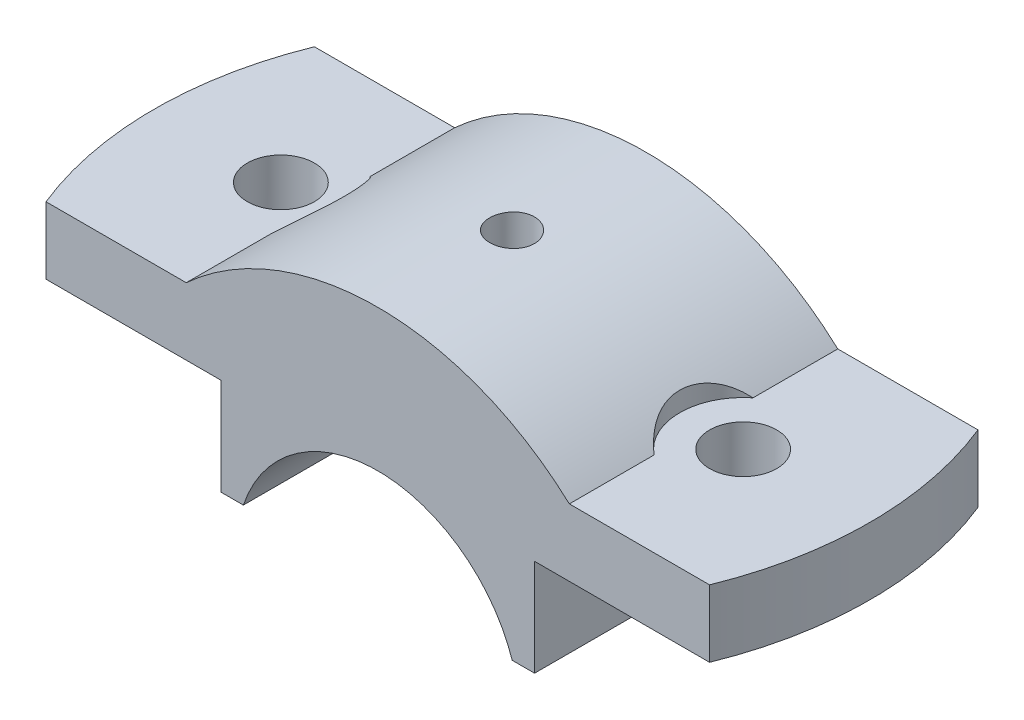
ISO-10303-21;
HEADER;
FILE_DESCRIPTION(('STEP AP214'),'2;1');
FILE_NAME('part.step','',(''),(''),'','','');
FILE_SCHEMA(('AUTOMOTIVE_DESIGN { 1 0 10303 214 1 1 1 1 }'));
ENDSEC;
DATA;
#1=APPLICATION_CONTEXT('core data for automotive mechanical design processes');
#2=APPLICATION_PROTOCOL_DEFINITION('international standard','automotive_design',2000,#1);
#3=PRODUCT_CONTEXT('',#1,'mechanical');
#4=PRODUCT('Part','Part','',(#3));
#5=PRODUCT_RELATED_PRODUCT_CATEGORY('part','',(#4));
#6=PRODUCT_DEFINITION_FORMATION('','',#4);
#7=PRODUCT_DEFINITION_CONTEXT('part definition',#1,'design');
#8=PRODUCT_DEFINITION('design','',#6,#7);
#9=PRODUCT_DEFINITION_SHAPE('','',#8);
#10=(LENGTH_UNIT() NAMED_UNIT(*) SI_UNIT(.MILLI.,.METRE.));
#11=(NAMED_UNIT(*) PLANE_ANGLE_UNIT() SI_UNIT($,.RADIAN.));
#12=(NAMED_UNIT(*) SI_UNIT($,.STERADIAN.) SOLID_ANGLE_UNIT());
#13=UNCERTAINTY_MEASURE_WITH_UNIT(LENGTH_MEASURE(1.E-05),#10,'distance_accuracy_value','');
#14=(GEOMETRIC_REPRESENTATION_CONTEXT(3) GLOBAL_UNCERTAINTY_ASSIGNED_CONTEXT((#13)) GLOBAL_UNIT_ASSIGNED_CONTEXT((#10,
#11,#12)) REPRESENTATION_CONTEXT('',''));
#15=CARTESIAN_POINT('',(0.,0.,0.));
#16=DIRECTION('',(0.,0.,1.));
#17=DIRECTION('',(1.,0.,0.));
#18=AXIS2_PLACEMENT_3D('',#15,#16,#17);
#19=CARTESIAN_POINT('',(50.,28.,18.));
#20=DIRECTION('',(0.,-1.,0.));
#21=DIRECTION('',(0.,0.,-1.));
#22=AXIS2_PLACEMENT_3D('',#19,#20,#21);
#23=PLANE('',#22);
#24=CARTESIAN_POINT('',(31.,28.,0.));
#25=DIRECTION('',(0.,1.,0.));
#26=DIRECTION('',(0.,0.,1.));
#27=AXIS2_PLACEMENT_3D('',#24,#25,#26);
#28=CIRCLE('',#27,4.49999999999999);
#29=CARTESIAN_POINT('',(31.,28.,4.49999999999999));
#30=VERTEX_POINT('',#29);
#31=EDGE_CURVE('E205',#30,#30,#28,.T.);
#32=ORIENTED_EDGE('',*,*,#31,.F.);
#33=EDGE_LOOP('',(#32));
#34=FACE_BOUND('',#33,.T.);
#35=CARTESIAN_POINT('',(0.,28.,0.));
#36=DIRECTION('',(0.,1.,0.));
#37=DIRECTION('',(0.,0.,1.));
#38=AXIS2_PLACEMENT_3D('',#35,#36,#37);
#39=CIRCLE('',#38,48.);
#40=CARTESIAN_POINT('',(44.497190922574,28.,18.));
#41=VERTEX_POINT('',#40);
#42=CARTESIAN_POINT('',(44.497190922574,28.,-18.));
#43=VERTEX_POINT('',#42);
#44=EDGE_CURVE('E130',#41,#43,#39,.T.);
#45=ORIENTED_EDGE('',*,*,#44,.T.);
#46=DIRECTION('',(-1.,0.,0.));
#47=VECTOR('',#46,1.);
#48=CARTESIAN_POINT('',(50.,28.,-18.));
#49=LINE('',#48,#47);
#50=CARTESIAN_POINT('',(25.6904651573303,28.,-18.));
#51=VERTEX_POINT('',#50);
#52=EDGE_CURVE('E139',#43,#51,#49,.T.);
#53=ORIENTED_EDGE('',*,*,#52,.T.);
#54=DIRECTION('',(0.,0.,-1.));
#55=VECTOR('',#54,1.);
#56=CARTESIAN_POINT('',(25.6904651573303,28.,18.));
#57=LINE('',#56,#55);
#58=CARTESIAN_POINT('',(25.6904651573303,28.,-6.63768331230678));
#59=VERTEX_POINT('',#58);
#60=EDGE_CURVE('E197',#59,#51,#57,.T.);
#61=ORIENTED_EDGE('',*,*,#60,.F.);
#62=CARTESIAN_POINT('',(31.,28.,0.));
#63=DIRECTION('',(0.,1.,0.));
#64=DIRECTION('',(0.,0.,1.));
#65=AXIS2_PLACEMENT_3D('',#62,#63,#64);
#66=CIRCLE('',#65,8.5);
#67=CARTESIAN_POINT('',(25.6904651573303,28.,6.63768331230678));
#68=VERTEX_POINT('',#67);
#69=EDGE_CURVE('E296',#59,#68,#66,.T.);
#70=ORIENTED_EDGE('',*,*,#69,.T.);
#71=CARTESIAN_POINT('',(25.6904651573303,28.,18.));
#72=VERTEX_POINT('',#71);
#73=EDGE_CURVE('E198',#72,#68,#57,.T.);
#74=ORIENTED_EDGE('',*,*,#73,.F.);
#75=DIRECTION('',(-1.,0.,0.));
#76=VECTOR('',#75,1.);
#77=CARTESIAN_POINT('',(50.,28.,18.));
#78=LINE('',#77,#76);
#79=EDGE_CURVE('E142',#41,#72,#78,.T.);
#80=ORIENTED_EDGE('',*,*,#79,.F.);
#81=EDGE_LOOP('',(#45,#53,#61,#70,#74,#80));
#82=FACE_BOUND('',#81,.T.);
#83=ADVANCED_FACE('F32',(#34,#82),#23,.F.);
#84=CARTESIAN_POINT('',(21.0277563773199,19.,18.));
#85=DIRECTION('',(0.,1.,0.));
#86=DIRECTION('',(0.,0.,1.));
#87=AXIS2_PLACEMENT_3D('',#84,#85,#86);
#88=PLANE('',#87);
#89=CARTESIAN_POINT('',(31.,19.,0.));
#90=DIRECTION('',(0.,1.,0.));
#91=DIRECTION('',(0.,0.,1.));
#92=AXIS2_PLACEMENT_3D('',#89,#90,#91);
#93=CIRCLE('',#92,4.49999999999999);
#94=CARTESIAN_POINT('',(31.,19.,4.49999999999999));
#95=VERTEX_POINT('',#94);
#96=EDGE_CURVE('E202',#95,#95,#93,.T.);
#97=ORIENTED_EDGE('',*,*,#96,.T.);
#98=EDGE_LOOP('',(#97));
#99=FACE_BOUND('',#98,.T.);
#100=CARTESIAN_POINT('',(0.,19.,0.));
#101=DIRECTION('',(0.,1.,0.));
#102=DIRECTION('',(0.,0.,1.));
#103=AXIS2_PLACEMENT_3D('',#100,#101,#102);
#104=CIRCLE('',#103,48.);
#105=CARTESIAN_POINT('',(44.497190922574,19.,18.));
#106=VERTEX_POINT('',#105);
#107=CARTESIAN_POINT('',(44.497190922574,19.,-18.));
#108=VERTEX_POINT('',#107);
#109=EDGE_CURVE('E45',#106,#108,#104,.T.);
#110=ORIENTED_EDGE('',*,*,#109,.F.);
#111=DIRECTION('',(1.,0.,0.));
#112=VECTOR('',#111,1.);
#113=CARTESIAN_POINT('',(21.0277563773199,19.,18.));
#114=LINE('',#113,#112);
#115=CARTESIAN_POINT('',(21.0277563773199,19.,18.));
#116=VERTEX_POINT('',#115);
#117=EDGE_CURVE('E157',#116,#106,#114,.T.);
#118=ORIENTED_EDGE('',*,*,#117,.F.);
#119=DIRECTION('',(0.,0.,-1.));
#120=VECTOR('',#119,1.);
#121=CARTESIAN_POINT('',(21.0277563773199,19.,18.));
#122=LINE('',#121,#120);
#123=CARTESIAN_POINT('',(21.0277563773199,19.,-18.));
#124=VERTEX_POINT('',#123);
#125=EDGE_CURVE('E179',#116,#124,#122,.T.);
#126=ORIENTED_EDGE('',*,*,#125,.T.);
#127=DIRECTION('',(1.,0.,0.));
#128=VECTOR('',#127,1.);
#129=CARTESIAN_POINT('',(21.0277563773199,19.,-18.));
#130=LINE('',#129,#128);
#131=EDGE_CURVE('E177',#124,#108,#130,.T.);
#132=ORIENTED_EDGE('',*,*,#131,.T.);
#133=EDGE_LOOP('',(#110,#118,#126,#132));
#134=FACE_BOUND('',#133,.T.);
#135=ADVANCED_FACE('F278',(#99,#134),#88,.F.);
#136=CARTESIAN_POINT('',(0.,0.,18.));
#137=DIRECTION('',(0.,0.,1.));
#138=DIRECTION('',(1.,0.,0.));
#139=AXIS2_PLACEMENT_3D('',#136,#137,#138);
#140=PLANE('',#139);
#141=ORIENTED_EDGE('',*,*,#117,.T.);
#142=DIRECTION('',(0.,1.,0.));
#143=VECTOR('',#142,1.);
#144=CARTESIAN_POINT('',(44.497190922574,6.,18.));
#145=LINE('',#144,#143);
#146=EDGE_CURVE('E143',#106,#41,#145,.T.);
#147=ORIENTED_EDGE('',*,*,#146,.T.);
#148=ORIENTED_EDGE('',*,*,#79,.T.);
#149=CARTESIAN_POINT('',(0.,0.,18.));
#150=DIRECTION('',(0.,0.,1.));
#151=DIRECTION('',(1.,0.,0.));
#152=AXIS2_PLACEMENT_3D('',#149,#150,#151);
#153=CIRCLE('',#152,38.);
#154=CARTESIAN_POINT('',(-25.6904651573303,28.,18.));
#155=VERTEX_POINT('',#154);
#156=EDGE_CURVE('E252',#72,#155,#153,.T.);
#157=ORIENTED_EDGE('',*,*,#156,.T.);
#158=DIRECTION('',(1.,0.,0.));
#159=VECTOR('',#158,1.);
#160=CARTESIAN_POINT('',(-50.,28.,18.));
#161=LINE('',#160,#159);
#162=CARTESIAN_POINT('',(-44.497190922574,28.,18.));
#163=VERTEX_POINT('',#162);
#164=EDGE_CURVE('E255',#163,#155,#161,.T.);
#165=ORIENTED_EDGE('',*,*,#164,.F.);
#166=DIRECTION('',(0.,1.,0.));
#167=VECTOR('',#166,1.);
#168=CARTESIAN_POINT('',(-44.497190922574,6.,18.));
#169=LINE('',#168,#167);
#170=CARTESIAN_POINT('',(-44.497190922574,19.,18.));
#171=VERTEX_POINT('',#170);
#172=EDGE_CURVE('E280',#171,#163,#169,.T.);
#173=ORIENTED_EDGE('',*,*,#172,.F.);
#174=DIRECTION('',(-1.,0.,0.));
#175=VECTOR('',#174,1.);
#176=CARTESIAN_POINT('',(-21.0277563773199,19.,18.));
#177=LINE('',#176,#175);
#178=CARTESIAN_POINT('',(-21.0277563773199,19.,18.));
#179=VERTEX_POINT('',#178);
#180=EDGE_CURVE('E257',#179,#171,#177,.T.);
#181=ORIENTED_EDGE('',*,*,#180,.F.);
#182=DIRECTION('',(0.,1.,0.));
#183=VECTOR('',#182,1.);
#184=CARTESIAN_POINT('',(-21.0277563773199,6.,18.));
#185=LINE('',#184,#183);
#186=CARTESIAN_POINT('',(-21.0277563773199,6.,18.));
#187=VERTEX_POINT('',#186);
#188=EDGE_CURVE('E260',#187,#179,#185,.T.);
#189=ORIENTED_EDGE('',*,*,#188,.F.);
#190=DIRECTION('',(-1.,0.,0.));
#191=VECTOR('',#190,1.);
#192=CARTESIAN_POINT('',(-18.0277563773199,6.,18.));
#193=LINE('',#192,#191);
#194=CARTESIAN_POINT('',(-18.0277563773199,6.,18.));
#195=VERTEX_POINT('',#194);
#196=EDGE_CURVE('E263',#195,#187,#193,.T.);
#197=ORIENTED_EDGE('',*,*,#196,.F.);
#198=CARTESIAN_POINT('',(0.,0.,18.));
#199=DIRECTION('',(0.,0.,1.));
#200=DIRECTION('',(1.,0.,0.));
#201=AXIS2_PLACEMENT_3D('',#198,#199,#200);
#202=CIRCLE('',#201,19.);
#203=CARTESIAN_POINT('',(18.0277563773199,6.,18.));
#204=VERTEX_POINT('',#203);
#205=EDGE_CURVE('E266',#204,#195,#202,.T.);
#206=ORIENTED_EDGE('',*,*,#205,.F.);
#207=DIRECTION('',(1.,0.,0.));
#208=VECTOR('',#207,1.);
#209=CARTESIAN_POINT('',(18.0277563773199,6.,18.));
#210=LINE('',#209,#208);
#211=CARTESIAN_POINT('',(21.0277563773199,6.,18.));
#212=VERTEX_POINT('',#211);
#213=EDGE_CURVE('E269',#204,#212,#210,.T.);
#214=ORIENTED_EDGE('',*,*,#213,.T.);
#215=DIRECTION('',(0.,1.,0.));
#216=VECTOR('',#215,1.);
#217=CARTESIAN_POINT('',(21.0277563773199,6.,18.));
#218=LINE('',#217,#216);
#219=EDGE_CURVE('E270',#212,#116,#218,.T.);
#220=ORIENTED_EDGE('',*,*,#219,.T.);
#221=EDGE_LOOP('',(#141,#147,#148,#157,#165,#173,#181,#189,#197,#206,#214,#220));
#222=FACE_BOUND('',#221,.T.);
#223=ADVANCED_FACE('F276',(#222),#140,.T.);
#224=CARTESIAN_POINT('',(0.,0.,-18.));
#225=DIRECTION('',(0.,0.,1.));
#226=DIRECTION('',(1.,0.,0.));
#227=AXIS2_PLACEMENT_3D('',#224,#225,#226);
#228=PLANE('',#227);
#229=DIRECTION('',(0.,1.,0.));
#230=VECTOR('',#229,1.);
#231=CARTESIAN_POINT('',(44.497190922574,6.,-18.));
#232=LINE('',#231,#230);
#233=EDGE_CURVE('E11',#108,#43,#232,.T.);
#234=ORIENTED_EDGE('',*,*,#233,.F.);
#235=ORIENTED_EDGE('',*,*,#131,.F.);
#236=DIRECTION('',(0.,1.,0.));
#237=VECTOR('',#236,1.);
#238=CARTESIAN_POINT('',(21.0277563773199,6.,-18.));
#239=LINE('',#238,#237);
#240=CARTESIAN_POINT('',(21.0277563773199,6.,-18.));
#241=VERTEX_POINT('',#240);
#242=EDGE_CURVE('E175',#241,#124,#239,.T.);
#243=ORIENTED_EDGE('',*,*,#242,.F.);
#244=DIRECTION('',(1.,0.,0.));
#245=VECTOR('',#244,1.);
#246=CARTESIAN_POINT('',(18.0277563773199,6.,-18.));
#247=LINE('',#246,#245);
#248=CARTESIAN_POINT('',(18.0277563773199,6.,-18.));
#249=VERTEX_POINT('',#248);
#250=EDGE_CURVE('E173',#249,#241,#247,.T.);
#251=ORIENTED_EDGE('',*,*,#250,.F.);
#252=CARTESIAN_POINT('',(0.,0.,-18.));
#253=DIRECTION('',(0.,0.,1.));
#254=DIRECTION('',(1.,0.,0.));
#255=AXIS2_PLACEMENT_3D('',#252,#253,#254);
#256=CIRCLE('',#255,19.);
#257=CARTESIAN_POINT('',(-18.0277563773199,6.,-18.));
#258=VERTEX_POINT('',#257);
#259=EDGE_CURVE('E170',#249,#258,#256,.T.);
#260=ORIENTED_EDGE('',*,*,#259,.T.);
#261=DIRECTION('',(-1.,0.,0.));
#262=VECTOR('',#261,1.);
#263=CARTESIAN_POINT('',(-18.0277563773199,6.,-18.));
#264=LINE('',#263,#262);
#265=CARTESIAN_POINT('',(-21.0277563773199,6.,-18.));
#266=VERTEX_POINT('',#265);
#267=EDGE_CURVE('E167',#258,#266,#264,.T.);
#268=ORIENTED_EDGE('',*,*,#267,.T.);
#269=DIRECTION('',(0.,1.,0.));
#270=VECTOR('',#269,1.);
#271=CARTESIAN_POINT('',(-21.0277563773199,6.,-18.));
#272=LINE('',#271,#270);
#273=CARTESIAN_POINT('',(-21.0277563773199,19.,-18.));
#274=VERTEX_POINT('',#273);
#275=EDGE_CURVE('E164',#266,#274,#272,.T.);
#276=ORIENTED_EDGE('',*,*,#275,.T.);
#277=DIRECTION('',(-1.,0.,0.));
#278=VECTOR('',#277,1.);
#279=CARTESIAN_POINT('',(-21.0277563773199,19.,-18.));
#280=LINE('',#279,#278);
#281=CARTESIAN_POINT('',(-44.497190922574,19.,-18.));
#282=VERTEX_POINT('',#281);
#283=EDGE_CURVE('E161',#274,#282,#280,.T.);
#284=ORIENTED_EDGE('',*,*,#283,.T.);
#285=DIRECTION('',(0.,1.,0.));
#286=VECTOR('',#285,1.);
#287=CARTESIAN_POINT('',(-44.497190922574,6.,-18.));
#288=LINE('',#287,#286);
#289=CARTESIAN_POINT('',(-44.497190922574,28.,-18.));
#290=VERTEX_POINT('',#289);
#291=EDGE_CURVE('E39',#282,#290,#288,.T.);
#292=ORIENTED_EDGE('',*,*,#291,.T.);
#293=DIRECTION('',(1.,0.,0.));
#294=VECTOR('',#293,1.);
#295=CARTESIAN_POINT('',(-50.,28.,-18.));
#296=LINE('',#295,#294);
#297=CARTESIAN_POINT('',(-25.6904651573303,28.,-18.));
#298=VERTEX_POINT('',#297);
#299=EDGE_CURVE('E151',#290,#298,#296,.T.);
#300=ORIENTED_EDGE('',*,*,#299,.T.);
#301=CARTESIAN_POINT('',(0.,0.,-18.));
#302=DIRECTION('',(0.,0.,1.));
#303=DIRECTION('',(1.,0.,0.));
#304=AXIS2_PLACEMENT_3D('',#301,#302,#303);
#305=CIRCLE('',#304,38.);
#306=EDGE_CURVE('E148',#51,#298,#305,.T.);
#307=ORIENTED_EDGE('',*,*,#306,.F.);
#308=ORIENTED_EDGE('',*,*,#52,.F.);
#309=EDGE_LOOP('',(#234,#235,#243,#251,#260,#268,#276,#284,#292,#300,#307,#308));
#310=FACE_BOUND('',#309,.T.);
#311=ADVANCED_FACE('F146',(#310),#228,.F.);
#312=CARTESIAN_POINT('',(0.,0.,18.));
#313=DIRECTION('',(0.,0.,-1.));
#314=DIRECTION('',(-1.,0.,0.));
#315=AXIS2_PLACEMENT_3D('',#312,#313,#314);
#316=CYLINDRICAL_SURFACE('',#315,38.);
#317=CARTESIAN_POINT('',(0.,38.,2.99999999999999));
#318=CARTESIAN_POINT('',(-0.168230277437706,37.9999984430739,2.99999263868346));
#319=CARTESIAN_POINT('',(-0.336575845655095,37.9988709200709,2.98580169916932));
#320=CARTESIAN_POINT('',(-0.668611397196742,37.9944814128081,2.92939894930333));
#321=CARTESIAN_POINT('',(-0.832295850092009,37.9912169949171,2.88715518982943));
#322=CARTESIAN_POINT('',(-1.15015205512757,37.9829226863334,2.77587406357067));
#323=CARTESIAN_POINT('',(-1.3043290493551,37.9778937789402,2.70685161752221));
#324=CARTESIAN_POINT('',(-1.59887136159142,37.9666348413683,2.54399853963546));
#325=CARTESIAN_POINT('',(-1.73923967362019,37.9604050724332,2.45017330191646));
#326=CARTESIAN_POINT('',(-2.00254103126273,37.9474277075509,2.24014409327318));
#327=CARTESIAN_POINT('',(-2.12543792166293,37.9406790810774,2.1238948563935));
#328=CARTESIAN_POINT('',(-2.34999780988339,37.9274332919605,1.87241281605956));
#329=CARTESIAN_POINT('',(-2.45165988585507,37.9209361402441,1.73717918887838));
#330=CARTESIAN_POINT('',(-2.63098484586302,37.9089176287414,1.45135065682847));
#331=CARTESIAN_POINT('',(-2.708616254697,37.903397552738,1.30073594623714));
#332=CARTESIAN_POINT('',(-2.83747510230931,37.8939696224707,0.988558849059875));
#333=CARTESIAN_POINT('',(-2.88870296451239,37.8900617423529,0.82699663808231));
#334=CARTESIAN_POINT('',(-2.96319644645853,37.8843090780475,0.497870679819641));
#335=CARTESIAN_POINT('',(-2.98652059882487,37.8824599758018,0.33032025735777));
#336=CARTESIAN_POINT('',(-3.00472536931325,37.8810204867557,-0.00632681714998041));
#337=CARTESIAN_POINT('',(-2.99960647157769,37.8814300615093,-0.175423442828302));
#338=CARTESIAN_POINT('',(-2.96111886260011,37.8844577346025,-0.509962310035282));
#339=CARTESIAN_POINT('',(-2.92781369865023,37.8870708648728,-0.675411913710737));
#340=CARTESIAN_POINT('',(-2.83399765916122,37.8942034046858,-0.998365215123264));
#341=CARTESIAN_POINT('',(-2.77348654183749,37.8987228311701,-1.15586884222906));
#342=CARTESIAN_POINT('',(-2.62690490032727,37.9091644380148,-1.45866214971911));
#343=CARTESIAN_POINT('',(-2.54080579129679,37.9150881856644,-1.60393793599879));
#344=CARTESIAN_POINT('',(-2.34551283184452,37.9276694800349,-1.87799978791044));
#345=CARTESIAN_POINT('',(-2.23631856235736,37.9343270400699,-2.0067855542603));
#346=CARTESIAN_POINT('',(-1.99757813910437,37.947647885739,-2.24458115896057));
#347=CARTESIAN_POINT('',(-1.86797703439473,37.9543111370687,-2.35353583758633));
#348=CARTESIAN_POINT('',(-1.59229376436976,37.9668751419437,-2.54815019879117));
#349=CARTESIAN_POINT('',(-1.44621158946688,37.9727758950454,-2.63380986781872));
#350=CARTESIAN_POINT('',(-1.14167761997913,37.983150993084,-2.77939892547026));
#351=CARTESIAN_POINT('',(-0.983224692335488,37.9876252071703,-2.83932595392175));
#352=CARTESIAN_POINT('',(-0.658463212690177,37.9946415451888,-2.93171041942903));
#353=CARTESIAN_POINT('',(-0.492154807064346,37.997183705107,-2.96416836811962));
#354=CARTESIAN_POINT('',(-0.156881478742684,38.0000448768352,-3.00062434440681));
#355=CARTESIAN_POINT('',(0.0120751089608379,38.0003698415183,-3.00469857910482));
#356=CARTESIAN_POINT('',(0.348269003373998,37.9987758913175,-2.98447098943402));
#357=CARTESIAN_POINT('',(0.515506324442483,37.9968569951891,-2.96016940224688));
#358=CARTESIAN_POINT('',(0.843297753735753,37.9909950041868,-2.88394314979588));
#359=CARTESIAN_POINT('',(1.00386010671882,37.987054491835,-2.83205372367032));
#360=CARTESIAN_POINT('',(1.31399900365978,37.9775920824189,-2.70216068710782));
#361=CARTESIAN_POINT('',(1.46357539119334,37.9720701628431,-2.62415670492505));
#362=CARTESIAN_POINT('',(1.74784375041781,37.9600494395666,-2.44405671040129));
#363=CARTESIAN_POINT('',(1.88250358772923,37.953548595394,-2.34191011569745));
#364=CARTESIAN_POINT('',(2.13279217984117,37.9403075453845,-2.11649766051109));
#365=CARTESIAN_POINT('',(2.24842063776818,37.9335673358158,-1.99323147064187));
#366=CARTESIAN_POINT('',(2.45762484975141,37.9205896766453,-1.72874864835165));
#367=CARTESIAN_POINT('',(2.55115094155127,37.9143533795852,-1.58749266904679));
#368=CARTESIAN_POINT('',(2.713155238272,37.9031055627809,-1.29123629441747));
#369=CARTESIAN_POINT('',(2.78163367119924,37.8980940318878,-1.13623602422189));
#370=CARTESIAN_POINT('',(2.89151387110068,37.8898693720601,-0.817068099787168));
#371=CARTESIAN_POINT('',(2.93294623887224,37.8866542112497,-0.652911034998946));
#372=CARTESIAN_POINT('',(2.98765790023766,37.8823793491511,-0.319943850373173));
#373=CARTESIAN_POINT('',(3.00093767292138,37.8813196111828,-0.151133809767669));
#374=CARTESIAN_POINT('',(2.99896188688675,37.8814760426207,0.185853858942923));
#375=CARTESIAN_POINT('',(2.98378436644711,37.8826859878913,0.354031953001599));
#376=CARTESIAN_POINT('',(2.92548733876923,37.887232237977,0.68544287301911));
#377=CARTESIAN_POINT('',(2.8823677867555,37.8905685461995,0.848675691052988));
#378=CARTESIAN_POINT('',(2.7694300101543,37.8989899804525,1.16556899687011));
#379=CARTESIAN_POINT('',(2.69961296444521,37.9040750292632,1.31922990697071));
#380=CARTESIAN_POINT('',(2.535271096382,37.9154210711218,1.61266178094886));
#381=CARTESIAN_POINT('',(2.44074672054794,37.9216820429175,1.75243299578316));
#382=CARTESIAN_POINT('',(2.22938062382269,37.9346948182221,2.01451680288399));
#383=CARTESIAN_POINT('',(2.11248130954251,37.941447859921,2.13678288515432));
#384=CARTESIAN_POINT('',(1.85978424897896,37.954672635902,2.36000556130416));
#385=CARTESIAN_POINT('',(1.72398192526551,37.9611443015481,2.46095697881558));
#386=CARTESIAN_POINT('',(1.43709756450133,37.9730876131211,2.63880542567551));
#387=CARTESIAN_POINT('',(1.2859897583193,37.978557527474,2.71566096437293));
#388=CARTESIAN_POINT('',(0.973076064569829,37.9878601967286,2.8428120018995));
#389=CARTESIAN_POINT('',(0.811282773093929,37.9916948408735,2.89313816633252));
#390=CARTESIAN_POINT('',(0.540438770546243,37.9963056825779,2.95292296572033));
#391=CARTESIAN_POINT('',(0.433132098217287,37.9976847801056,2.97055353917027));
#392=CARTESIAN_POINT('',(0.217232975456249,37.9995324404705,2.99409441950641));
#393=CARTESIAN_POINT('',(0.108640528034262,38.0000010054389,3.0000047538251));
#394=CARTESIAN_POINT('',(0.,38.,2.99999999999999));
#395=B_SPLINE_CURVE_WITH_KNOTS('',3,(#317,#318,#319,#320,#321,#322,#323,#324,#325,#326,#327,
#328,#329,#330,#331,#332,#333,#334,#335,#336,#337,#338,#339,#340,#341,#342,#343,#344,#345,#346,
#347,#348,#349,#350,#351,#352,#353,#354,#355,#356,#357,#358,#359,#360,#361,#362,#363,#364,#365,
#366,#367,#368,#369,#370,#371,#372,#373,#374,#375,#376,#377,#378,#379,#380,#381,#382,#383,#384,
#385,#386,#387,#388,#389,#390,#391,#392,#393,#394),.UNSPECIFIED.,.T.,.F.,(4,2,2,2,2,2,2,2,2,2,2,
2,2,2,2,2,2,2,2,2,2,2,2,2,2,2,2,2,2,2,2,2,2,2,2,2,2,2,4),(0.,0.504294188546741,1.00916370078726,
1.51375230936014,2.01823126998903,2.52373945491489,3.02926958047039,3.53545907123702,
4.04164044416132,4.54675814609821,5.05186725021795,5.55584058602808,6.05981840083593,
6.56436134901272,7.06891345298728,7.57484819748388,8.08078323629979,8.58676466907349,
9.09273667730811,9.5973496818578,10.1019584685879,10.6059242398502,11.1098971854695,
11.6149355386039,12.1199817691652,12.6261522324058,13.1323180879118,13.6379102536977,
14.1434938154447,14.6476929456065,15.1518928837201,15.6560705605014,16.1602391262259,
16.6657233184336,17.1713301290485,17.6778028214877,18.183688785524,18.5093549854356,
18.8350204230892),.UNSPECIFIED.);
#396=CARTESIAN_POINT('',(0.,38.,2.99999999999999));
#397=VERTEX_POINT('',#396);
#398=EDGE_CURVE('E212',#397,#397,#395,.T.);
#399=ORIENTED_EDGE('',*,*,#398,.T.);
#400=EDGE_LOOP('',(#399));
#401=FACE_BOUND('',#400,.T.);
#402=CARTESIAN_POINT('',(25.6904651573303,28.,-6.63768331230679));
#403=CARTESIAN_POINT('',(25.5360851043424,28.1416681018721,-6.51420867249736));
#404=CARTESIAN_POINT('',(25.3836215551735,28.2791823336498,-6.38340380017067));
#405=CARTESIAN_POINT('',(25.0841053598261,28.5451833866574,-6.10685950724569));
#406=CARTESIAN_POINT('',(24.9370580895264,28.6736613482156,-5.96110576476092));
#407=CARTESIAN_POINT('',(24.6491941230388,28.9215085426633,-5.65349144226199));
#408=CARTESIAN_POINT('',(24.508431723833,29.0408031542341,-5.49151942353939));
#409=CARTESIAN_POINT('',(24.2363075607749,29.2682904084011,-5.15263687836668));
#410=CARTESIAN_POINT('',(24.1049430857226,29.3764862568107,-4.9757306926307));
#411=CARTESIAN_POINT('',(23.8528205053459,29.5815743674557,-4.60631493821571));
#412=CARTESIAN_POINT('',(23.7321338833277,29.6783916917415,-4.41371469093333));
#413=CARTESIAN_POINT('',(23.5043908446779,29.85908164754,-4.01479632179464));
#414=CARTESIAN_POINT('',(23.3973358972541,29.942952883943,-3.80847672492269));
#415=CARTESIAN_POINT('',(23.1992536300817,30.0966827286364,-3.38422419101503));
#416=CARTESIAN_POINT('',(23.1081729651954,30.1665880882949,-3.16633319991269));
#417=CARTESIAN_POINT('',(22.9434688496595,30.2920447623401,-2.72008092153074));
#418=CARTESIAN_POINT('',(22.869842066784,30.347598816803,-2.49172164276592));
#419=CARTESIAN_POINT('',(22.7499342032063,30.4375648556656,-2.05682098381955));
#420=CARTESIAN_POINT('',(22.7013462567531,30.4737833576563,-1.85128534823191));
#421=CARTESIAN_POINT('',(22.6194172898017,30.534645499234,-1.43551725204114));
#422=CARTESIAN_POINT('',(22.5860747992536,30.5592902548309,-1.2252852463389));
#423=CARTESIAN_POINT('',(22.5352129551669,30.5968164834569,-0.801799591498524));
#424=CARTESIAN_POINT('',(22.5176992505084,30.6096937569973,-0.588544891193918));
#425=CARTESIAN_POINT('',(22.4988301660851,30.6235658271181,-0.160939560666232));
#426=CARTESIAN_POINT('',(22.4974739036633,30.624561272785,0.0534110090511351));
#427=CARTESIAN_POINT('',(22.5103301119086,30.6151119876343,0.461997479818151));
#428=CARTESIAN_POINT('',(22.5231488228924,30.6056914251709,0.656303160135776));
#429=CARTESIAN_POINT('',(22.5619809221014,30.5770763766543,1.04286259298841));
#430=CARTESIAN_POINT('',(22.5879939672906,30.5578821447042,1.23511639873688));
#431=CARTESIAN_POINT('',(22.6528192304938,30.5098574663833,1.61613906729809));
#432=CARTESIAN_POINT('',(22.6916259266854,30.4810311771979,1.80490939654948));
#433=CARTESIAN_POINT('',(22.7814851533843,30.4139289484325,2.17779604427594));
#434=CARTESIAN_POINT('',(22.8325379785097,30.3756527815061,2.36191225066403));
#435=CARTESIAN_POINT('',(22.9463727274414,30.2897519777021,2.72495933677602));
#436=CARTESIAN_POINT('',(23.0091940590921,30.2420959034169,2.90387039063446));
#437=CARTESIAN_POINT('',(23.1456283742011,30.1378044455698,3.25489148863349));
#438=CARTESIAN_POINT('',(23.2192449894415,30.0811660396201,3.42699921914349));
#439=CARTESIAN_POINT('',(23.3763137314078,29.9592695660632,3.76349373210636));
#440=CARTESIAN_POINT('',(23.4597660818508,29.8940113023904,3.92788033882065));
#441=CARTESIAN_POINT('',(23.635527045378,29.7552415450916,4.24828704232642));
#442=CARTESIAN_POINT('',(23.7278387953854,29.6817271265587,4.40430414494655));
#443=CARTESIAN_POINT('',(23.9282386479047,29.5204551498758,4.71995510834891));
#444=CARTESIAN_POINT('',(24.0370002176616,29.432022004933,4.87881602386905));
#445=CARTESIAN_POINT('',(24.2623844714665,29.2465042091278,5.18563329619879));
#446=CARTESIAN_POINT('',(24.379010630913,29.149415727248,5.33358477081361));
#447=CARTESIAN_POINT('',(24.6187042069683,28.9472618083659,5.61815393006345));
#448=CARTESIAN_POINT('',(24.7417672458198,28.8422017715012,5.75477915839727));
#449=CARTESIAN_POINT('',(24.9931857635632,28.6246099475779,6.016738259449));
#450=CARTESIAN_POINT('',(25.121541230047,28.5120781780363,6.14207215863704));
#451=CARTESIAN_POINT('',(25.3239635142993,28.3320696328102,6.32788833390873));
#452=CARTESIAN_POINT('',(25.3966039536003,28.2669811541268,6.39227987552884));
#453=CARTESIAN_POINT('',(25.5428336292653,28.1349133065772,6.51755974656749));
#454=CARTESIAN_POINT('',(25.6164208573993,28.0679376662269,6.57845434819234));
#455=CARTESIAN_POINT('',(25.6904651573302,28.0000000000002,6.63768331230704));
#456=B_SPLINE_CURVE_WITH_KNOTS('',3,(#402,#403,#404,#405,#406,#407,#408,#409,#410,#411,#412,
#413,#414,#415,#416,#417,#418,#419,#420,#421,#422,#423,#424,#425,#426,#427,#428,#429,#430,#431,
#432,#433,#434,#435,#436,#437,#438,#439,#440,#441,#442,#443,#444,#445,#446,#447,#448,#449,#450,
#451,#452,#453,#454,#455),.UNSPECIFIED.,.F.,.F.,(4,2,2,2,2,2,2,2,2,2,2,2,2,2,2,2,2,2,2,2,2,2,2,
2,2,2,4),(0.,0.729592400834072,1.45989044138351,2.19560470883998,2.93110586753775,
3.67120763552798,4.41138910352642,5.14904966030397,5.88656927223679,6.52855006409984,
7.17046893961488,7.8126168088522,8.45472959834445,9.03890309081731,9.62306139629813,
10.2069679046447,10.7908884620571,11.3768004587137,11.9629100238154,12.549032922753,
13.1353641263273,13.7703169673958,14.4055522594533,15.040361004022,15.6751682603777,
16.0257258218313,16.3756336015193),.UNSPECIFIED.);
#457=EDGE_CURVE('E201',#59,#68,#456,.T.);
#458=ORIENTED_EDGE('',*,*,#457,.F.);
#459=ORIENTED_EDGE('',*,*,#60,.T.);
#460=ORIENTED_EDGE('',*,*,#306,.T.);
#461=DIRECTION('',(0.,0.,-1.));
#462=VECTOR('',#461,1.);
#463=CARTESIAN_POINT('',(-25.6904651573303,28.,18.));
#464=LINE('',#463,#462);
#465=CARTESIAN_POINT('',(-25.6904651573303,28.,-6.63768331230679));
#466=VERTEX_POINT('',#465);
#467=EDGE_CURVE('E193',#466,#298,#464,.T.);
#468=ORIENTED_EDGE('',*,*,#467,.F.);
#469=CARTESIAN_POINT('',(-25.6904651573303,28.,-6.63768331230679));
#470=CARTESIAN_POINT('',(-25.5360851043424,28.1416681018721,-6.51420867249736));
#471=CARTESIAN_POINT('',(-25.3836215551735,28.2791823336498,-6.38340380017067));
#472=CARTESIAN_POINT('',(-25.0841053598261,28.5451833866574,-6.1068595072457));
#473=CARTESIAN_POINT('',(-24.9370580895264,28.6736613482156,-5.96110576476093));
#474=CARTESIAN_POINT('',(-24.6491941230388,28.9215085426633,-5.65349144226199));
#475=CARTESIAN_POINT('',(-24.508431723833,29.0408031542341,-5.49151942353939));
#476=CARTESIAN_POINT('',(-24.2363075607749,29.2682904084011,-5.15263687836669));
#477=CARTESIAN_POINT('',(-24.1049430857226,29.3764862568107,-4.97573069263071));
#478=CARTESIAN_POINT('',(-23.8528205053459,29.5815743674557,-4.60631493821572));
#479=CARTESIAN_POINT('',(-23.7321338833277,29.6783916917415,-4.41371469093334));
#480=CARTESIAN_POINT('',(-23.5043908446779,29.85908164754,-4.01479632179464));
#481=CARTESIAN_POINT('',(-23.3973358972541,29.942952883943,-3.80847672492269));
#482=CARTESIAN_POINT('',(-23.1992536300817,30.0966827286364,-3.38422419101504));
#483=CARTESIAN_POINT('',(-23.1081729651954,30.1665880882949,-3.1663331999127));
#484=CARTESIAN_POINT('',(-22.9434688496595,30.2920447623401,-2.72008092153074));
#485=CARTESIAN_POINT('',(-22.869842066784,30.347598816803,-2.49172164276593));
#486=CARTESIAN_POINT('',(-22.7499342032063,30.4375648556656,-2.05682098381955));
#487=CARTESIAN_POINT('',(-22.7013462567531,30.4737833576563,-1.85128534823191));
#488=CARTESIAN_POINT('',(-22.6194172898017,30.534645499234,-1.43551725204115));
#489=CARTESIAN_POINT('',(-22.5860747992536,30.5592902548309,-1.2252852463389));
#490=CARTESIAN_POINT('',(-22.5352129551669,30.5968164834569,-0.801799591498527));
#491=CARTESIAN_POINT('',(-22.5176992505084,30.6096937569973,-0.588544891193921));
#492=CARTESIAN_POINT('',(-22.4988301660851,30.6235658271181,-0.160939560666234));
#493=CARTESIAN_POINT('',(-22.4974739036633,30.624561272785,0.0534110090511331));
#494=CARTESIAN_POINT('',(-22.5103301119086,30.6151119876343,0.461997479818149));
#495=CARTESIAN_POINT('',(-22.5231488228924,30.6056914251709,0.656303160135775));
#496=CARTESIAN_POINT('',(-22.5619809221014,30.5770763766543,1.04286259298841));
#497=CARTESIAN_POINT('',(-22.5879939672906,30.5578821447042,1.23511639873689));
#498=CARTESIAN_POINT('',(-22.6528192304938,30.5098574663833,1.6161390672981));
#499=CARTESIAN_POINT('',(-22.6916259266854,30.4810311771979,1.80490939654949));
#500=CARTESIAN_POINT('',(-22.7814851533843,30.4139289484325,2.17779604427594));
#501=CARTESIAN_POINT('',(-22.8325379785097,30.3756527815061,2.36191225066403));
#502=CARTESIAN_POINT('',(-22.9463727274414,30.2897519777021,2.72495933677603));
#503=CARTESIAN_POINT('',(-23.0091940590921,30.2420959034169,2.90387039063447));
#504=CARTESIAN_POINT('',(-23.1456283742011,30.1378044455698,3.2548914886335));
#505=CARTESIAN_POINT('',(-23.2192449894415,30.0811660396201,3.4269992191435));
#506=CARTESIAN_POINT('',(-23.3763137314078,29.9592695660632,3.76349373210637));
#507=CARTESIAN_POINT('',(-23.4597660818508,29.8940113023904,3.92788033882065));
#508=CARTESIAN_POINT('',(-23.635527045378,29.7552415450916,4.24828704232642));
#509=CARTESIAN_POINT('',(-23.7278387953854,29.6817271265587,4.40430414494655));
#510=CARTESIAN_POINT('',(-23.9282386479047,29.5204551498758,4.71995510834892));
#511=CARTESIAN_POINT('',(-24.0370002176616,29.432022004933,4.87881602386906));
#512=CARTESIAN_POINT('',(-24.2623844714665,29.2465042091278,5.1856332961988));
#513=CARTESIAN_POINT('',(-24.379010630913,29.1494157272481,5.33358477081362));
#514=CARTESIAN_POINT('',(-24.6187042069683,28.9472618083659,5.61815393006346));
#515=CARTESIAN_POINT('',(-24.7417672458198,28.8422017715012,5.75477915839727));
#516=CARTESIAN_POINT('',(-24.9931857635632,28.6246099475779,6.016738259449));
#517=CARTESIAN_POINT('',(-25.121541230047,28.5120781780363,6.14207215863705));
#518=CARTESIAN_POINT('',(-25.3239635142993,28.3320696328102,6.32788833390874));
#519=CARTESIAN_POINT('',(-25.3966039536003,28.2669811541268,6.39227987552885));
#520=CARTESIAN_POINT('',(-25.5428336292653,28.1349133065772,6.5175597465675));
#521=CARTESIAN_POINT('',(-25.6164208573994,28.0679376662269,6.57845434819235));
#522=CARTESIAN_POINT('',(-25.6904651573302,28.0000000000002,6.63768331230705));
#523=B_SPLINE_CURVE_WITH_KNOTS('',3,(#469,#470,#471,#472,#473,#474,#475,#476,#477,#478,#479,
#480,#481,#482,#483,#484,#485,#486,#487,#488,#489,#490,#491,#492,#493,#494,#495,#496,#497,#498,
#499,#500,#501,#502,#503,#504,#505,#506,#507,#508,#509,#510,#511,#512,#513,#514,#515,#516,#517,
#518,#519,#520,#521,#522),.UNSPECIFIED.,.F.,.F.,(4,2,2,2,2,2,2,2,2,2,2,2,2,2,2,2,2,2,2,2,2,2,2,
2,2,2,4),(0.,0.729592400834072,1.45989044138352,2.19560470883998,2.93110586753775,
3.67120763552798,4.41138910352642,5.14904966030397,5.88656927223679,6.52855006409984,
7.17046893961488,7.8126168088522,8.45472959834445,9.03890309081731,9.62306139629813,
10.2069679046447,10.7908884620571,11.3768004587137,11.9629100238154,12.549032922753,
13.1353641263273,13.7703169673958,14.4055522594533,15.040361004022,15.6751682603777,
16.0257258218313,16.3756336015193),.UNSPECIFIED.);
#524=CARTESIAN_POINT('',(-25.6904651573303,28.,6.63768331230679));
#525=VERTEX_POINT('',#524);
#526=EDGE_CURVE('E238',#466,#525,#523,.T.);
#527=ORIENTED_EDGE('',*,*,#526,.T.);
#528=EDGE_CURVE('E194',#155,#525,#464,.T.);
#529=ORIENTED_EDGE('',*,*,#528,.F.);
#530=ORIENTED_EDGE('',*,*,#156,.F.);
#531=ORIENTED_EDGE('',*,*,#73,.T.);
#532=EDGE_LOOP('',(#458,#459,#460,#468,#527,#529,#530,#531));
#533=FACE_BOUND('',#532,.T.);
#534=ADVANCED_FACE('F217',(#401,#533),#316,.T.);
#535=CARTESIAN_POINT('',(-50.,28.,18.));
#536=DIRECTION('',(0.,1.,0.));
#537=DIRECTION('',(0.,0.,1.));
#538=AXIS2_PLACEMENT_3D('',#535,#536,#537);
#539=PLANE('',#538);
#540=CARTESIAN_POINT('',(0.,28.,0.));
#541=DIRECTION('',(0.,-1.,0.));
#542=DIRECTION('',(0.,0.,1.));
#543=AXIS2_PLACEMENT_3D('',#540,#541,#542);
#544=CIRCLE('',#543,48.);
#545=EDGE_CURVE('E53',#163,#290,#544,.T.);
#546=ORIENTED_EDGE('',*,*,#545,.F.);
#547=ORIENTED_EDGE('',*,*,#164,.T.);
#548=ORIENTED_EDGE('',*,*,#528,.T.);
#549=CARTESIAN_POINT('',(-31.,28.,0.));
#550=DIRECTION('',(0.,1.,0.));
#551=DIRECTION('',(0.,0.,1.));
#552=AXIS2_PLACEMENT_3D('',#549,#550,#551);
#553=CIRCLE('',#552,8.5);
#554=EDGE_CURVE('E245',#466,#525,#553,.F.);
#555=ORIENTED_EDGE('',*,*,#554,.F.);
#556=ORIENTED_EDGE('',*,*,#467,.T.);
#557=ORIENTED_EDGE('',*,*,#299,.F.);
#558=EDGE_LOOP('',(#546,#547,#548,#555,#556,#557));
#559=FACE_BOUND('',#558,.T.);
#560=CARTESIAN_POINT('',(-31.,28.,0.));
#561=DIRECTION('',(0.,1.,0.));
#562=DIRECTION('',(0.,0.,1.));
#563=AXIS2_PLACEMENT_3D('',#560,#561,#562);
#564=CIRCLE('',#563,4.49999999999999);
#565=CARTESIAN_POINT('',(-31.,28.,4.49999999999999));
#566=VERTEX_POINT('',#565);
#567=EDGE_CURVE('E154',#566,#566,#564,.T.);
#568=ORIENTED_EDGE('',*,*,#567,.F.);
#569=EDGE_LOOP('',(#568));
#570=FACE_BOUND('',#569,.T.);
#571=ADVANCED_FACE('F321',(#559,#570),#539,.T.);
#572=CARTESIAN_POINT('',(-21.0277563773199,19.,18.));
#573=DIRECTION('',(0.,-1.,0.));
#574=DIRECTION('',(0.,0.,-1.));
#575=AXIS2_PLACEMENT_3D('',#572,#573,#574);
#576=PLANE('',#575);
#577=CARTESIAN_POINT('',(0.,19.,0.));
#578=DIRECTION('',(0.,-1.,0.));
#579=DIRECTION('',(0.,0.,-1.));
#580=AXIS2_PLACEMENT_3D('',#577,#578,#579);
#581=CIRCLE('',#580,48.);
#582=EDGE_CURVE('E285',#282,#171,#581,.F.);
#583=ORIENTED_EDGE('',*,*,#582,.F.);
#584=ORIENTED_EDGE('',*,*,#283,.F.);
#585=DIRECTION('',(0.,0.,-1.));
#586=VECTOR('',#585,1.);
#587=CARTESIAN_POINT('',(-21.0277563773199,19.,18.));
#588=LINE('',#587,#586);
#589=EDGE_CURVE('E191',#179,#274,#588,.T.);
#590=ORIENTED_EDGE('',*,*,#589,.F.);
#591=ORIENTED_EDGE('',*,*,#180,.T.);
#592=EDGE_LOOP('',(#583,#584,#590,#591));
#593=FACE_BOUND('',#592,.T.);
#594=CARTESIAN_POINT('',(-31.,19.,0.));
#595=DIRECTION('',(0.,-1.,0.));
#596=DIRECTION('',(0.,0.,-1.));
#597=AXIS2_PLACEMENT_3D('',#594,#595,#596);
#598=CIRCLE('',#597,4.49999999999999);
#599=CARTESIAN_POINT('',(-31.,19.,-4.49999999999999));
#600=VERTEX_POINT('',#599);
#601=EDGE_CURVE('E149',#600,#600,#598,.T.);
#602=ORIENTED_EDGE('',*,*,#601,.F.);
#603=EDGE_LOOP('',(#602));
#604=FACE_BOUND('',#603,.T.);
#605=ADVANCED_FACE('F318',(#593,#604),#576,.T.);
#606=CARTESIAN_POINT('',(-21.0277563773199,6.,18.));
#607=DIRECTION('',(-1.,0.,0.));
#608=DIRECTION('',(0.,0.,1.));
#609=AXIS2_PLACEMENT_3D('',#606,#607,#608);
#610=PLANE('',#609);
#611=ORIENTED_EDGE('',*,*,#275,.F.);
#612=DIRECTION('',(0.,0.,-1.));
#613=VECTOR('',#612,1.);
#614=CARTESIAN_POINT('',(-21.0277563773199,6.,18.));
#615=LINE('',#614,#613);
#616=EDGE_CURVE('E189',#187,#266,#615,.T.);
#617=ORIENTED_EDGE('',*,*,#616,.F.);
#618=ORIENTED_EDGE('',*,*,#188,.T.);
#619=ORIENTED_EDGE('',*,*,#589,.T.);
#620=EDGE_LOOP('',(#611,#617,#618,#619));
#621=FACE_BOUND('',#620,.T.);
#622=ADVANCED_FACE('F314',(#621),#610,.T.);
#623=CARTESIAN_POINT('',(-18.0277563773199,6.,18.));
#624=DIRECTION('',(0.,-1.,0.));
#625=DIRECTION('',(0.,0.,-1.));
#626=AXIS2_PLACEMENT_3D('',#623,#624,#625);
#627=PLANE('',#626);
#628=ORIENTED_EDGE('',*,*,#267,.F.);
#629=DIRECTION('',(0.,0.,-1.));
#630=VECTOR('',#629,1.);
#631=CARTESIAN_POINT('',(-18.0277563773199,6.,18.));
#632=LINE('',#631,#630);
#633=EDGE_CURVE('E187',#195,#258,#632,.T.);
#634=ORIENTED_EDGE('',*,*,#633,.F.);
#635=ORIENTED_EDGE('',*,*,#196,.T.);
#636=ORIENTED_EDGE('',*,*,#616,.T.);
#637=EDGE_LOOP('',(#628,#634,#635,#636));
#638=FACE_BOUND('',#637,.T.);
#639=ADVANCED_FACE('F309',(#638),#627,.T.);
#640=CARTESIAN_POINT('',(0.,0.,18.));
#641=DIRECTION('',(0.,0.,-1.));
#642=DIRECTION('',(-1.,0.,0.));
#643=AXIS2_PLACEMENT_3D('',#640,#641,#642);
#644=CYLINDRICAL_SURFACE('',#643,19.);
#645=CARTESIAN_POINT('',(0.,19.,2.49999999999999));
#646=CARTESIAN_POINT('',(-0.139778315489381,18.999997967774,2.49999410094607));
#647=CARTESIAN_POINT('',(-0.279642447495432,18.9984412683557,2.48823767475851));
#648=CARTESIAN_POINT('',(-0.555474474016763,18.9923810422329,2.44152700403634));
#649=CARTESIAN_POINT('',(-0.691438217949602,18.9878744896332,2.40654893872552));
#650=CARTESIAN_POINT('',(-0.955436642925262,18.9764219373405,2.31444705906101));
#651=CARTESIAN_POINT('',(-1.08347675216936,18.9694776299244,2.25733860465933));
#652=CARTESIAN_POINT('',(-1.32813277832855,18.9539206812215,2.12263165454414));
#653=CARTESIAN_POINT('',(-1.44475055826477,18.9453083126858,2.04503650793576));
#654=CARTESIAN_POINT('',(-1.66398308687909,18.9273173646443,1.87105538112386));
#655=CARTESIAN_POINT('',(-1.76651843289981,18.9179348817316,1.77456973952705));
#656=CARTESIAN_POINT('',(-1.95399133146886,18.8994924119599,1.56576064733009));
#657=CARTESIAN_POINT('',(-2.0389279601093,18.890432442053,1.4534363657436));
#658=CARTESIAN_POINT('',(-2.18909162338547,18.8736225658863,1.21561789849417));
#659=CARTESIAN_POINT('',(-2.254243636291,18.8658776941045,1.09007595594652));
#660=CARTESIAN_POINT('',(-2.36250946256606,18.8526269269547,0.829713309668851));
#661=CARTESIAN_POINT('',(-2.40562420041089,18.8471209376663,0.694892995440666));
#662=CARTESIAN_POINT('',(-2.46834893112872,18.8390089488849,0.420627771177585));
#663=CARTESIAN_POINT('',(-2.48809350572304,18.8363863510935,0.281214139706503));
#664=CARTESIAN_POINT('',(-2.50393399543624,18.8342874081065,0.00102942145374164));
#665=CARTESIAN_POINT('',(-2.50003096100306,18.8348109231579,-0.139741604753912));
#666=CARTESIAN_POINT('',(-2.46879737750757,18.8389298660036,-0.417704097944481));
#667=CARTESIAN_POINT('',(-2.44161547626707,18.8425058020086,-0.554912597936802));
#668=CARTESIAN_POINT('',(-2.36482786882149,18.852296258763,-0.822803762753463));
#669=CARTESIAN_POINT('',(-2.31522166359116,18.8585108382319,-0.953486282278279));
#670=CARTESIAN_POINT('',(-2.19483509097754,18.8729003199956,-1.20507533515602));
#671=CARTESIAN_POINT('',(-2.12399053069557,18.8810811502029,-1.3259507990106));
#672=CARTESIAN_POINT('',(-1.96318413435717,18.8984768576706,-1.55415393130079));
#673=CARTESIAN_POINT('',(-1.87322133002782,18.9076917872934,-1.66148091311362));
#674=CARTESIAN_POINT('',(-1.67591027855668,18.9262039286229,-1.8604029509214));
#675=CARTESIAN_POINT('',(-1.5684339827901,18.9355012293485,-1.95187103488117));
#676=CARTESIAN_POINT('',(-1.33958658891131,18.9530645440151,-2.11548884034055));
#677=CARTESIAN_POINT('',(-1.21821545257772,18.9613305551191,-2.18763850869799));
#678=CARTESIAN_POINT('',(-0.964922757293814,18.9759058695861,-2.31057308687671));
#679=CARTESIAN_POINT('',(-0.832997072631037,18.9822144030351,-2.36134959301125));
#680=CARTESIAN_POINT('',(-0.562390331231886,18.9921571388021,-2.43999334343768));
#681=CARTESIAN_POINT('',(-0.423709625549348,18.9957914799383,-2.4678617769038));
#682=CARTESIAN_POINT('',(-0.144626841595052,18.9999582136113,-2.49973268466772));
#683=CARTESIAN_POINT('',(-0.00424505397900315,19.0005133278906,-2.50390998199236));
#684=CARTESIAN_POINT('',(0.275216665266614,18.9985205333266,-2.48874205734629));
#685=CARTESIAN_POINT('',(0.414296627611642,18.9959726978817,-2.46939739177319));
#686=CARTESIAN_POINT('',(0.686687509149987,18.9880744020358,-2.40787994096775));
#687=CARTESIAN_POINT('',(0.82001767900448,18.9827342327916,-2.36579096106223));
#688=CARTESIAN_POINT('',(1.07772769061604,18.9698488481686,-2.26006706877667));
#689=CARTESIAN_POINT('',(1.20210719868891,18.9623035506347,-2.19643135362992));
#690=CARTESIAN_POINT('',(1.43916303555311,18.9457917882835,-2.04900056518348));
#691=CARTESIAN_POINT('',(1.55176881159961,18.9368174879556,-1.96509294211364));
#692=CARTESIAN_POINT('',(1.76136182953435,18.9184749473973,-1.77965876593364));
#693=CARTESIAN_POINT('',(1.85834838132062,18.9091066897838,-1.67813143474596));
#694=CARTESIAN_POINT('',(2.03457405133124,18.8909615049602,-1.45956767417581));
#695=CARTESIAN_POINT('',(2.11369695379328,18.882188695812,-1.34243714901302));
#696=CARTESIAN_POINT('',(2.25114524350548,18.8662967388838,-1.0964463235499));
#697=CARTESIAN_POINT('',(2.30947108507653,18.8591775549807,-0.96758627956325));
#698=CARTESIAN_POINT('',(2.40348340588748,18.8474274353122,-0.70216224479824));
#699=CARTESIAN_POINT('',(2.43923433050313,18.8427894223098,-0.565621407141434));
#700=CARTESIAN_POINT('',(2.48728896692711,18.8365068588229,-0.288409154438022));
#701=CARTESIAN_POINT('',(2.49959389747028,18.834862152745,-0.14773795447576));
#702=CARTESIAN_POINT('',(2.50038325713136,18.8347572836292,0.132585217903333));
#703=CARTESIAN_POINT('',(2.48905029281034,18.8362727080523,0.272236701943021));
#704=CARTESIAN_POINT('',(2.44327339157393,18.8422647251657,0.547631014500267));
#705=CARTESIAN_POINT('',(2.40882946081797,18.8467413170668,0.68337384405953));
#706=CARTESIAN_POINT('',(2.31786734754336,18.8581434764999,0.947066981095644));
#707=CARTESIAN_POINT('',(2.26135895042261,18.8650679582854,1.0750207139318));
#708=CARTESIAN_POINT('',(2.12788991460023,18.8805873470396,1.3196597242388));
#709=CARTESIAN_POINT('',(2.05092891076782,18.8891822838294,1.4363448004849));
#710=CARTESIAN_POINT('',(1.87806508524071,18.9071536004537,1.65606643442981));
#711=CARTESIAN_POINT('',(1.78202633147283,18.916535291463,1.75899562327552));
#712=CARTESIAN_POINT('',(1.57401834863999,18.9349767535594,1.94734544374448));
#713=CARTESIAN_POINT('',(1.46204538383397,18.9440364485309,2.03276195806478));
#714=CARTESIAN_POINT('',(1.22480279057949,18.9608556769231,2.1839722390681));
#715=CARTESIAN_POINT('',(1.09947920166897,18.9686095798624,2.24968193582438));
#716=CARTESIAN_POINT('',(0.839540973043678,18.9818871351467,2.35902730105119));
#717=CARTESIAN_POINT('',(0.704936491101716,18.9874131818538,2.40268668066817));
#718=CARTESIAN_POINT('',(0.474714442967833,18.9942975150946,2.45637452622467));
#719=CARTESIAN_POINT('',(0.380541684686487,18.9964253917168,2.47271020697245));
#720=CARTESIAN_POINT('',(0.19092595858504,18.9992773223142,2.49452491255805));
#721=CARTESIAN_POINT('',(0.0954830015668614,19.0000013882199,2.50000402966206));
#722=CARTESIAN_POINT('',(0.,19.,2.49999999999999));
#723=B_SPLINE_CURVE_WITH_KNOTS('',3,(#645,#646,#647,#648,#649,#650,#651,#652,#653,#654,#655,
#656,#657,#658,#659,#660,#661,#662,#663,#664,#665,#666,#667,#668,#669,#670,#671,#672,#673,#674,
#675,#676,#677,#678,#679,#680,#681,#682,#683,#684,#685,#686,#687,#688,#689,#690,#691,#692,#693,
#694,#695,#696,#697,#698,#699,#700,#701,#702,#703,#704,#705,#706,#707,#708,#709,#710,#711,#712,
#713,#714,#715,#716,#717,#718,#719,#720,#721,#722),.UNSPECIFIED.,.T.,.F.,(4,2,2,2,2,2,2,2,2,2,2,
2,2,2,2,2,2,2,2,2,2,2,2,2,2,2,2,2,2,2,2,2,2,2,2,2,2,2,4),(0.,0.418986144750715,
0.838402751295031,1.25752877489171,1.67658632335898,2.09791737096997,2.5192705322666,
2.94220203521432,3.36511579450622,3.78558208482051,4.20602969778295,4.62381238038423,
5.04160436068184,5.46067207111285,5.87976101093415,6.30206422391833,6.72436859858556,
7.14683886382431,7.56928719694782,7.98861407741508,8.40793103915517,8.82571338706287,
9.24351130200042,9.66368440831748,10.0838760739927,10.5067272952287,10.9295692785285,
11.3511986374782,11.7728060793191,12.1911686022117,12.6095310136043,13.027708095279,
13.4458926429742,13.8671712161902,14.2885487204711,14.7116990687392,15.1343934209874,
15.4206065905888,15.7068173277526),.UNSPECIFIED.);
#724=CARTESIAN_POINT('',(0.,19.,2.49999999999999));
#725=VERTEX_POINT('',#724);
#726=EDGE_CURVE('E295',#725,#725,#723,.T.);
#727=ORIENTED_EDGE('',*,*,#726,.F.);
#728=EDGE_LOOP('',(#727));
#729=FACE_BOUND('',#728,.T.);
#730=ORIENTED_EDGE('',*,*,#259,.F.);
#731=DIRECTION('',(0.,0.,-1.));
#732=VECTOR('',#731,1.);
#733=CARTESIAN_POINT('',(18.0277563773199,6.,18.));
#734=LINE('',#733,#732);
#735=EDGE_CURVE('E185',#204,#249,#734,.T.);
#736=ORIENTED_EDGE('',*,*,#735,.F.);
#737=ORIENTED_EDGE('',*,*,#205,.T.);
#738=ORIENTED_EDGE('',*,*,#633,.T.);
#739=EDGE_LOOP('',(#730,#736,#737,#738));
#740=FACE_BOUND('',#739,.T.);
#741=ADVANCED_FACE('F303',(#729,#740),#644,.F.);
#742=CARTESIAN_POINT('',(18.0277563773199,6.,18.));
#743=DIRECTION('',(0.,1.,0.));
#744=DIRECTION('',(0.,0.,1.));
#745=AXIS2_PLACEMENT_3D('',#742,#743,#744);
#746=PLANE('',#745);
#747=ORIENTED_EDGE('',*,*,#250,.T.);
#748=DIRECTION('',(0.,0.,-1.));
#749=VECTOR('',#748,1.);
#750=CARTESIAN_POINT('',(21.0277563773199,6.,18.));
#751=LINE('',#750,#749);
#752=EDGE_CURVE('E182',#212,#241,#751,.T.);
#753=ORIENTED_EDGE('',*,*,#752,.F.);
#754=ORIENTED_EDGE('',*,*,#213,.F.);
#755=ORIENTED_EDGE('',*,*,#735,.T.);
#756=EDGE_LOOP('',(#747,#753,#754,#755));
#757=FACE_BOUND('',#756,.T.);
#758=ADVANCED_FACE('F308',(#757),#746,.F.);
#759=CARTESIAN_POINT('',(21.0277563773199,6.,18.));
#760=DIRECTION('',(-1.,0.,0.));
#761=DIRECTION('',(0.,0.,1.));
#762=AXIS2_PLACEMENT_3D('',#759,#760,#761);
#763=PLANE('',#762);
#764=ORIENTED_EDGE('',*,*,#242,.T.);
#765=ORIENTED_EDGE('',*,*,#125,.F.);
#766=ORIENTED_EDGE('',*,*,#219,.F.);
#767=ORIENTED_EDGE('',*,*,#752,.T.);
#768=EDGE_LOOP('',(#764,#765,#766,#767));
#769=FACE_BOUND('',#768,.T.);
#770=ADVANCED_FACE('F348',(#769),#763,.F.);
#771=CARTESIAN_POINT('',(-31.,28.,0.));
#772=DIRECTION('',(0.,1.,0.));
#773=DIRECTION('',(0.,0.,1.));
#774=AXIS2_PLACEMENT_3D('',#771,#772,#773);
#775=CYLINDRICAL_SURFACE('',#774,4.49999999999999);
#776=ORIENTED_EDGE('',*,*,#601,.T.);
#777=EDGE_LOOP('',(#776));
#778=FACE_BOUND('',#777,.T.);
#779=ORIENTED_EDGE('',*,*,#567,.T.);
#780=EDGE_LOOP('',(#779));
#781=FACE_BOUND('',#780,.T.);
#782=ADVANCED_FACE('F343',(#778,#781),#775,.F.);
#783=CARTESIAN_POINT('',(31.,28.,0.));
#784=DIRECTION('',(0.,1.,0.));
#785=DIRECTION('',(0.,0.,1.));
#786=AXIS2_PLACEMENT_3D('',#783,#784,#785);
#787=CYLINDRICAL_SURFACE('',#786,4.49999999999999);
#788=ORIENTED_EDGE('',*,*,#31,.T.);
#789=EDGE_LOOP('',(#788));
#790=FACE_BOUND('',#789,.T.);
#791=ORIENTED_EDGE('',*,*,#96,.F.);
#792=EDGE_LOOP('',(#791));
#793=FACE_BOUND('',#792,.T.);
#794=ADVANCED_FACE('F234',(#790,#793),#787,.F.);
#795=CARTESIAN_POINT('',(-31.,3.95836943965738,0.));
#796=DIRECTION('',(0.,1.,0.));
#797=DIRECTION('',(0.,0.,1.));
#798=AXIS2_PLACEMENT_3D('',#795,#796,#797);
#799=CYLINDRICAL_SURFACE('',#798,8.5);
#800=ORIENTED_EDGE('',*,*,#554,.T.);
#801=ORIENTED_EDGE('',*,*,#526,.F.);
#802=EDGE_LOOP('',(#800,#801));
#803=FACE_BOUND('',#802,.T.);
#804=ADVANCED_FACE('F226',(#803),#799,.F.);
#805=CARTESIAN_POINT('',(31.,73.,0.));
#806=DIRECTION('',(0.,-1.,0.));
#807=DIRECTION('',(0.,0.,-1.));
#808=AXIS2_PLACEMENT_3D('',#805,#806,#807);
#809=CYLINDRICAL_SURFACE('',#808,8.5);
#810=ORIENTED_EDGE('',*,*,#457,.T.);
#811=ORIENTED_EDGE('',*,*,#69,.F.);
#812=EDGE_LOOP('',(#810,#811));
#813=FACE_BOUND('',#812,.T.);
#814=ADVANCED_FACE('F220',(#813),#809,.F.);
#815=CARTESIAN_POINT('',(0.,38.,0.));
#816=DIRECTION('',(0.,1.,0.));
#817=DIRECTION('',(0.,0.,1.));
#818=AXIS2_PLACEMENT_3D('',#815,#816,#817);
#819=CYLINDRICAL_SURFACE('',#818,2.99999999999999);
#820=CARTESIAN_POINT('',(0.,25.,0.));
#821=DIRECTION('',(0.,1.,0.));
#822=DIRECTION('',(0.,0.,1.));
#823=AXIS2_PLACEMENT_3D('',#820,#821,#822);
#824=CIRCLE('',#823,2.99999999999999);
#825=CARTESIAN_POINT('',(0.,25.,2.99999999999999));
#826=VERTEX_POINT('',#825);
#827=EDGE_CURVE('E287',#826,#826,#824,.T.);
#828=ORIENTED_EDGE('',*,*,#827,.F.);
#829=EDGE_LOOP('',(#828));
#830=FACE_BOUND('',#829,.T.);
#831=ORIENTED_EDGE('',*,*,#398,.F.);
#832=EDGE_LOOP('',(#831));
#833=FACE_BOUND('',#832,.T.);
#834=ADVANCED_FACE('F225',(#830,#833),#819,.F.);
#835=CARTESIAN_POINT('',(0.,38.,0.));
#836=DIRECTION('',(0.,1.,0.));
#837=DIRECTION('',(0.,0.,1.));
#838=AXIS2_PLACEMENT_3D('',#835,#836,#837);
#839=CYLINDRICAL_SURFACE('',#838,2.49999999999999);
#840=ORIENTED_EDGE('',*,*,#726,.T.);
#841=EDGE_LOOP('',(#840));
#842=FACE_BOUND('',#841,.T.);
#843=CARTESIAN_POINT('',(0.,24.505,0.));
#844=DIRECTION('',(0.,1.,0.));
#845=DIRECTION('',(0.,0.,1.));
#846=AXIS2_PLACEMENT_3D('',#843,#844,#845);
#847=CIRCLE('',#846,2.5);
#848=CARTESIAN_POINT('',(0.,24.505,2.5));
#849=VERTEX_POINT('',#848);
#850=EDGE_CURVE('E293',#849,#849,#847,.T.);
#851=ORIENTED_EDGE('',*,*,#850,.T.);
#852=EDGE_LOOP('',(#851));
#853=FACE_BOUND('',#852,.T.);
#854=ADVANCED_FACE('F228',(#842,#853),#839,.F.);
#855=CARTESIAN_POINT('',(0.,25.,0.));
#856=DIRECTION('',(0.,1.,0.));
#857=DIRECTION('',(0.,0.,1.));
#858=AXIS2_PLACEMENT_3D('',#855,#856,#857);
#859=CONICAL_SURFACE('',#858,2.995,0.78539816339745);
#860=ORIENTED_EDGE('',*,*,#850,.F.);
#861=EDGE_LOOP('',(#860));
#862=FACE_BOUND('',#861,.T.);
#863=CARTESIAN_POINT('',(0.,25.,0.));
#864=DIRECTION('',(0.,1.,0.));
#865=DIRECTION('',(0.,0.,1.));
#866=AXIS2_PLACEMENT_3D('',#863,#864,#865);
#867=CIRCLE('',#866,2.995);
#868=CARTESIAN_POINT('',(0.,25.,2.995));
#869=VERTEX_POINT('',#868);
#870=EDGE_CURVE('E290',#869,#869,#867,.T.);
#871=ORIENTED_EDGE('',*,*,#870,.T.);
#872=EDGE_LOOP('',(#871));
#873=FACE_BOUND('',#872,.T.);
#874=ADVANCED_FACE('F399',(#862,#873),#859,.F.);
#875=CARTESIAN_POINT('',(2.995,25.,0.));
#876=DIRECTION('',(0.,-1.,0.));
#877=DIRECTION('',(0.,0.,-1.));
#878=AXIS2_PLACEMENT_3D('',#875,#876,#877);
#879=PLANE('',#878);
#880=ORIENTED_EDGE('',*,*,#870,.F.);
#881=EDGE_LOOP('',(#880));
#882=FACE_BOUND('',#881,.T.);
#883=ORIENTED_EDGE('',*,*,#827,.T.);
#884=EDGE_LOOP('',(#883));
#885=FACE_BOUND('',#884,.T.);
#886=ADVANCED_FACE('F379',(#882,#885),#879,.F.);
#887=CARTESIAN_POINT('',(0.,6.,0.));
#888=DIRECTION('',(0.,1.,0.));
#889=DIRECTION('',(0.,0.,1.));
#890=AXIS2_PLACEMENT_3D('',#887,#888,#889);
#891=CYLINDRICAL_SURFACE('',#890,48.);
#892=ORIENTED_EDGE('',*,*,#582,.T.);
#893=ORIENTED_EDGE('',*,*,#172,.T.);
#894=ORIENTED_EDGE('',*,*,#545,.T.);
#895=ORIENTED_EDGE('',*,*,#291,.F.);
#896=EDGE_LOOP('',(#892,#893,#894,#895));
#897=FACE_BOUND('',#896,.T.);
#898=ADVANCED_FACE('F371',(#897),#891,.T.);
#899=CARTESIAN_POINT('',(0.,6.,0.));
#900=DIRECTION('',(0.,1.,0.));
#901=DIRECTION('',(0.,0.,1.));
#902=AXIS2_PLACEMENT_3D('',#899,#900,#901);
#903=CYLINDRICAL_SURFACE('',#902,48.);
#904=ORIENTED_EDGE('',*,*,#109,.T.);
#905=ORIENTED_EDGE('',*,*,#233,.T.);
#906=ORIENTED_EDGE('',*,*,#44,.F.);
#907=ORIENTED_EDGE('',*,*,#146,.F.);
#908=EDGE_LOOP('',(#904,#905,#906,#907));
#909=FACE_BOUND('',#908,.T.);
#910=ADVANCED_FACE('F129',(#909),#903,.T.);
#911=CLOSED_SHELL('',(#83,#135,#223,#311,#534,#571,#605,#622,#639,#741,#758,#770,#782,#794,#804,
#814,#834,#854,#874,#886,#898,#910));
#912=MANIFOLD_SOLID_BREP('B2',#911);
#913=ADVANCED_BREP_SHAPE_REPRESENTATION('',(#18,#912),#14);
#914=SHAPE_DEFINITION_REPRESENTATION(#9,#913);
ENDSEC;
END-ISO-10303-21;
